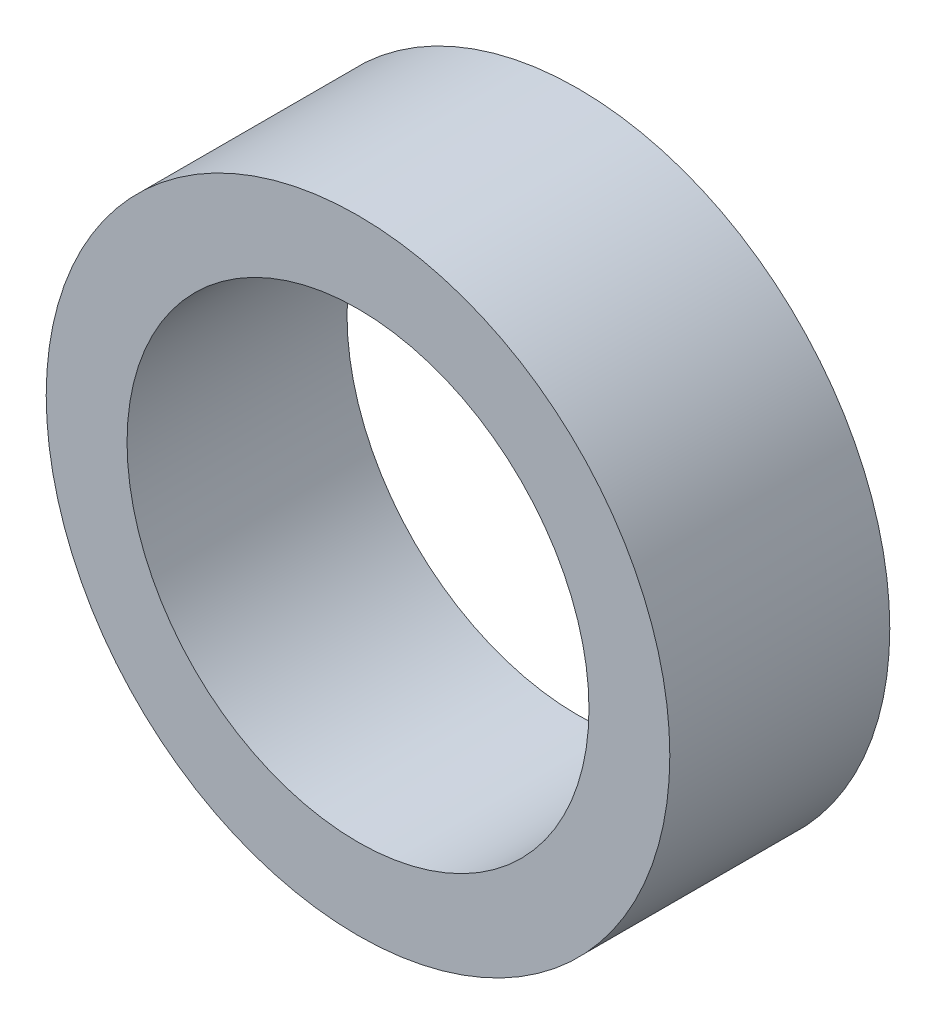
ISO-10303-21;
HEADER;
FILE_DESCRIPTION(('STEP AP214'),'2;1');
FILE_NAME('part.step','',(''),(''),'','','');
FILE_SCHEMA(('AUTOMOTIVE_DESIGN { 1 0 10303 214 1 1 1 1 }'));
ENDSEC;
DATA;
#1=APPLICATION_CONTEXT('core data for automotive mechanical design processes');
#2=APPLICATION_PROTOCOL_DEFINITION('international standard','automotive_design',2000,#1);
#3=PRODUCT_CONTEXT('',#1,'mechanical');
#4=PRODUCT('Part','Part','',(#3));
#5=PRODUCT_RELATED_PRODUCT_CATEGORY('part','',(#4));
#6=PRODUCT_DEFINITION_FORMATION('','',#4);
#7=PRODUCT_DEFINITION_CONTEXT('part definition',#1,'design');
#8=PRODUCT_DEFINITION('design','',#6,#7);
#9=PRODUCT_DEFINITION_SHAPE('','',#8);
#10=(LENGTH_UNIT() NAMED_UNIT(*) SI_UNIT(.MILLI.,.METRE.));
#11=(NAMED_UNIT(*) PLANE_ANGLE_UNIT() SI_UNIT($,.RADIAN.));
#12=(NAMED_UNIT(*) SI_UNIT($,.STERADIAN.) SOLID_ANGLE_UNIT());
#13=UNCERTAINTY_MEASURE_WITH_UNIT(LENGTH_MEASURE(1.E-05),#10,'distance_accuracy_value','');
#14=(GEOMETRIC_REPRESENTATION_CONTEXT(3) GLOBAL_UNCERTAINTY_ASSIGNED_CONTEXT((#13)) GLOBAL_UNIT_ASSIGNED_CONTEXT((#10,
#11,#12)) REPRESENTATION_CONTEXT('',''));
#15=CARTESIAN_POINT('',(0.,0.,0.));
#16=DIRECTION('',(0.,0.,1.));
#17=DIRECTION('',(1.,0.,0.));
#18=AXIS2_PLACEMENT_3D('',#15,#16,#17);
#19=CARTESIAN_POINT('',(0.,0.,20.));
#20=DIRECTION('',(0.,0.,1.));
#21=DIRECTION('',(1.,0.,0.));
#22=AXIS2_PLACEMENT_3D('',#19,#20,#21);
#23=PLANE('',#22);
#24=CARTESIAN_POINT('',(0.,0.,20.));
#25=DIRECTION('',(0.,0.,1.));
#26=DIRECTION('',(1.,0.,0.));
#27=AXIS2_PLACEMENT_3D('',#24,#25,#26);
#28=CIRCLE('',#27,28.35);
#29=CARTESIAN_POINT('',(28.35,0.,20.));
#30=VERTEX_POINT('',#29);
#31=EDGE_CURVE('E10',#30,#30,#28,.T.);
#32=ORIENTED_EDGE('',*,*,#31,.T.);
#33=EDGE_LOOP('',(#32));
#34=FACE_BOUND('',#33,.T.);
#35=CARTESIAN_POINT('',(0.,0.,20.));
#36=DIRECTION('',(0.,0.,1.));
#37=DIRECTION('',(1.,0.,0.));
#38=AXIS2_PLACEMENT_3D('',#35,#36,#37);
#39=CIRCLE('',#38,21.);
#40=CARTESIAN_POINT('',(21.,0.,20.));
#41=VERTEX_POINT('',#40);
#42=EDGE_CURVE('E50',#41,#41,#39,.T.);
#43=ORIENTED_EDGE('',*,*,#42,.F.);
#44=EDGE_LOOP('',(#43));
#45=FACE_BOUND('',#44,.T.);
#46=ADVANCED_FACE('F37',(#34,#45),#23,.T.);
#47=CARTESIAN_POINT('',(0.,0.,0.));
#48=DIRECTION('',(0.,0.,1.));
#49=DIRECTION('',(1.,0.,0.));
#50=AXIS2_PLACEMENT_3D('',#47,#48,#49);
#51=PLANE('',#50);
#52=CARTESIAN_POINT('',(0.,0.,0.));
#53=DIRECTION('',(0.,0.,1.));
#54=DIRECTION('',(1.,0.,0.));
#55=AXIS2_PLACEMENT_3D('',#52,#53,#54);
#56=CIRCLE('',#55,28.35);
#57=CARTESIAN_POINT('',(28.35,0.,0.));
#58=VERTEX_POINT('',#57);
#59=EDGE_CURVE('E41',#58,#58,#56,.T.);
#60=ORIENTED_EDGE('',*,*,#59,.F.);
#61=EDGE_LOOP('',(#60));
#62=FACE_BOUND('',#61,.T.);
#63=CARTESIAN_POINT('',(0.,0.,0.));
#64=DIRECTION('',(0.,0.,1.));
#65=DIRECTION('',(1.,0.,0.));
#66=AXIS2_PLACEMENT_3D('',#63,#64,#65);
#67=CIRCLE('',#66,21.);
#68=CARTESIAN_POINT('',(21.,0.,0.));
#69=VERTEX_POINT('',#68);
#70=EDGE_CURVE('E52',#69,#69,#67,.T.);
#71=ORIENTED_EDGE('',*,*,#70,.T.);
#72=EDGE_LOOP('',(#71));
#73=FACE_BOUND('',#72,.T.);
#74=ADVANCED_FACE('F64',(#62,#73),#51,.F.);
#75=CARTESIAN_POINT('',(0.,0.,20.));
#76=DIRECTION('',(0.,0.,-1.));
#77=DIRECTION('',(-1.,0.,0.));
#78=AXIS2_PLACEMENT_3D('',#75,#76,#77);
#79=CYLINDRICAL_SURFACE('',#78,28.35);
#80=ORIENTED_EDGE('',*,*,#31,.F.);
#81=EDGE_LOOP('',(#80));
#82=FACE_BOUND('',#81,.T.);
#83=ORIENTED_EDGE('',*,*,#59,.T.);
#84=EDGE_LOOP('',(#83));
#85=FACE_BOUND('',#84,.T.);
#86=ADVANCED_FACE('F39',(#82,#85),#79,.T.);
#87=CARTESIAN_POINT('',(0.,0.,20.));
#88=DIRECTION('',(0.,0.,-1.));
#89=DIRECTION('',(-1.,0.,0.));
#90=AXIS2_PLACEMENT_3D('',#87,#88,#89);
#91=CYLINDRICAL_SURFACE('',#90,21.);
#92=ORIENTED_EDGE('',*,*,#42,.T.);
#93=EDGE_LOOP('',(#92));
#94=FACE_BOUND('',#93,.T.);
#95=ORIENTED_EDGE('',*,*,#70,.F.);
#96=EDGE_LOOP('',(#95));
#97=FACE_BOUND('',#96,.T.);
#98=ADVANCED_FACE('F60',(#94,#97),#91,.F.);
#99=CLOSED_SHELL('',(#46,#74,#86,#98));
#100=MANIFOLD_SOLID_BREP('B2',#99);
#101=ADVANCED_BREP_SHAPE_REPRESENTATION('',(#18,#100),#14);
#102=SHAPE_DEFINITION_REPRESENTATION(#9,#101);
ENDSEC;
END-ISO-10303-21;
